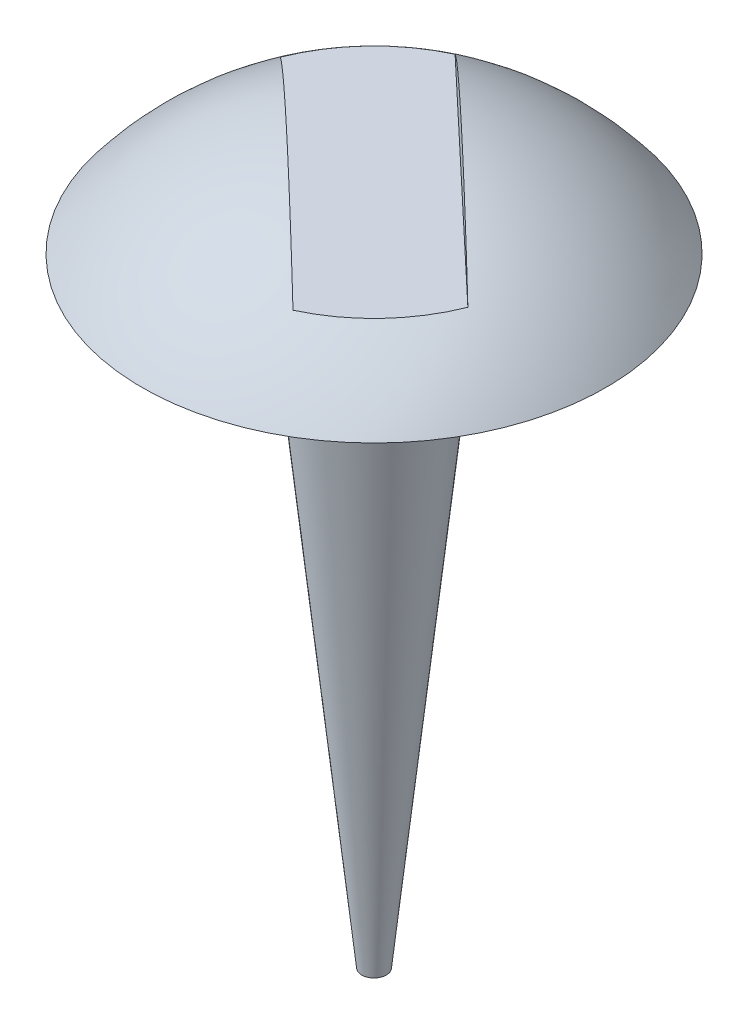
ISO-10303-21;
HEADER;
FILE_DESCRIPTION(('STEP AP214'),'2;1');
FILE_NAME('part.step','',(''),(''),'','','');
FILE_SCHEMA(('AUTOMOTIVE_DESIGN { 1 0 10303 214 1 1 1 1 }'));
ENDSEC;
DATA;
#1=APPLICATION_CONTEXT('core data for automotive mechanical design processes');
#2=APPLICATION_PROTOCOL_DEFINITION('international standard','automotive_design',2000,#1);
#3=PRODUCT_CONTEXT('',#1,'mechanical');
#4=PRODUCT('Part','Part','',(#3));
#5=PRODUCT_RELATED_PRODUCT_CATEGORY('part','',(#4));
#6=PRODUCT_DEFINITION_FORMATION('','',#4);
#7=PRODUCT_DEFINITION_CONTEXT('part definition',#1,'design');
#8=PRODUCT_DEFINITION('design','',#6,#7);
#9=PRODUCT_DEFINITION_SHAPE('','',#8);
#10=(LENGTH_UNIT() NAMED_UNIT(*) SI_UNIT(.MILLI.,.METRE.));
#11=(NAMED_UNIT(*) PLANE_ANGLE_UNIT() SI_UNIT($,.RADIAN.));
#12=(NAMED_UNIT(*) SI_UNIT($,.STERADIAN.) SOLID_ANGLE_UNIT());
#13=UNCERTAINTY_MEASURE_WITH_UNIT(LENGTH_MEASURE(1.E-05),#10,'distance_accuracy_value','');
#14=(GEOMETRIC_REPRESENTATION_CONTEXT(3) GLOBAL_UNCERTAINTY_ASSIGNED_CONTEXT((#13)) GLOBAL_UNIT_ASSIGNED_CONTEXT((#10,
#11,#12)) REPRESENTATION_CONTEXT('',''));
#15=CARTESIAN_POINT('',(0.,0.,0.));
#16=DIRECTION('',(0.,0.,1.));
#17=DIRECTION('',(1.,0.,0.));
#18=AXIS2_PLACEMENT_3D('',#15,#16,#17);
#19=CARTESIAN_POINT('',(0.,0.,0.));
#20=DIRECTION('',(0.,1.,0.));
#21=DIRECTION('',(0.,0.,1.));
#22=AXIS2_PLACEMENT_3D('',#19,#20,#21);
#23=PLANE('',#22);
#24=CARTESIAN_POINT('',(0.,0.,0.));
#25=DIRECTION('',(0.,-1.,0.));
#26=DIRECTION('',(0.,0.,-1.));
#27=AXIS2_PLACEMENT_3D('',#24,#25,#26);
#28=CIRCLE('',#27,0.300000000000002);
#29=CARTESIAN_POINT('',(0.,0.,-0.300000000000002));
#30=VERTEX_POINT('',#29);
#31=EDGE_CURVE('E75',#30,#30,#28,.T.);
#32=ORIENTED_EDGE('',*,*,#31,.T.);
#33=EDGE_LOOP('',(#32));
#34=FACE_BOUND('',#33,.T.);
#35=CARTESIAN_POINT('',(0.,0.,0.));
#36=DIRECTION('',(0.,1.,0.));
#37=DIRECTION('',(0.,0.,1.));
#38=AXIS2_PLACEMENT_3D('',#35,#36,#37);
#39=CIRCLE('',#38,0.1);
#40=CARTESIAN_POINT('',(0.,0.,0.1));
#41=VERTEX_POINT('',#40);
#42=EDGE_CURVE('E71',#41,#41,#39,.F.);
#43=ORIENTED_EDGE('',*,*,#42,.F.);
#44=EDGE_LOOP('',(#43));
#45=FACE_BOUND('',#44,.T.);
#46=ADVANCED_FACE('F33',(#34,#45),#23,.F.);
#47=CARTESIAN_POINT('',(0.,-0.231324998084971,0.));
#48=DIRECTION('',(0.,-1.,0.));
#49=DIRECTION('',(1.,0.,0.));
#50=AXIS2_PLACEMENT_3D('',#47,#48,#49);
#51=SPHERICAL_SURFACE('',#50,0.378828793439745);
#52=CARTESIAN_POINT('',(0.0548952647499614,-0.231324998084971,-0.0581937273942101));
#53=DIRECTION('',(-0.686190809374518,0.,0.727421592427626));
#54=DIRECTION('',(0.727421592427626,0.,0.686190809374518));
#55=AXIS2_PLACEMENT_3D('',#52,#53,#54);
#56=CIRCLE('',#55,0.370285369328864);
#57=CARTESIAN_POINT('',(0.200721071162538,0.08,0.0793665666245485));
#58=VERTEX_POINT('',#57);
#59=CARTESIAN_POINT('',(-0.0909305416626154,0.08,-0.195754021412969));
#60=VERTEX_POINT('',#59);
#61=EDGE_CURVE('E65',#58,#60,#56,.T.);
#62=ORIENTED_EDGE('',*,*,#61,.F.);
#63=CARTESIAN_POINT('',(0.,0.08,0.));
#64=DIRECTION('',(0.,-1.,0.));
#65=DIRECTION('',(0.,0.,-1.));
#66=AXIS2_PLACEMENT_3D('',#63,#64,#65);
#67=CIRCLE('',#66,0.215842535906168);
#68=CARTESIAN_POINT('',(0.0909305416626153,0.08,0.195754021412969));
#69=VERTEX_POINT('',#68);
#70=EDGE_CURVE('E11',#58,#69,#67,.T.);
#71=ORIENTED_EDGE('',*,*,#70,.T.);
#72=CARTESIAN_POINT('',(-0.0548952647499615,-0.231324998084971,0.0581937273942102));
#73=DIRECTION('',(-0.686190809374518,0.,0.727421592427626));
#74=DIRECTION('',(0.727421592427626,0.,0.686190809374518));
#75=AXIS2_PLACEMENT_3D('',#72,#73,#74);
#76=CIRCLE('',#75,0.370285369328864);
#77=CARTESIAN_POINT('',(-0.200721071162538,0.08,-0.0793665666245484));
#78=VERTEX_POINT('',#77);
#79=EDGE_CURVE('E37',#69,#78,#76,.T.);
#80=ORIENTED_EDGE('',*,*,#79,.T.);
#81=EDGE_CURVE('E43',#78,#60,#67,.T.);
#82=ORIENTED_EDGE('',*,*,#81,.T.);
#83=EDGE_LOOP('',(#62,#71,#80,#82));
#84=FACE_BOUND('',#83,.T.);
#85=ORIENTED_EDGE('',*,*,#31,.F.);
#86=EDGE_LOOP('',(#85));
#87=FACE_BOUND('',#86,.T.);
#88=ADVANCED_FACE('F35',(#84,#87),#51,.T.);
#89=CARTESIAN_POINT('',(0.,0.,0.));
#90=DIRECTION('',(0.,1.,0.));
#91=DIRECTION('',(0.,0.,-1.));
#92=AXIS2_PLACEMENT_3D('',#89,#90,#91);
#93=CONICAL_SURFACE('',#92,0.1,0.10471975511966);
#94=CARTESIAN_POINT('',(0.,-0.8,0.));
#95=DIRECTION('',(0.,-1.,0.));
#96=DIRECTION('',(0.,0.,-1.));
#97=AXIS2_PLACEMENT_3D('',#94,#95,#96);
#98=CIRCLE('',#97,0.0159166117874586);
#99=CARTESIAN_POINT('',(0.,-0.8,-0.0159166117874586));
#100=VERTEX_POINT('',#99);
#101=EDGE_CURVE('E78',#100,#100,#98,.T.);
#102=ORIENTED_EDGE('',*,*,#101,.F.);
#103=EDGE_LOOP('',(#102));
#104=FACE_BOUND('',#103,.T.);
#105=ORIENTED_EDGE('',*,*,#42,.T.);
#106=EDGE_LOOP('',(#105));
#107=FACE_BOUND('',#106,.T.);
#108=ADVANCED_FACE('F85',(#104,#107),#93,.T.);
#109=CARTESIAN_POINT('',(0.,-0.8,0.));
#110=DIRECTION('',(0.,-1.,0.));
#111=DIRECTION('',(0.,0.,-1.));
#112=AXIS2_PLACEMENT_3D('',#109,#110,#111);
#113=PLANE('',#112);
#114=ORIENTED_EDGE('',*,*,#101,.T.);
#115=EDGE_LOOP('',(#114));
#116=FACE_BOUND('',#115,.T.);
#117=ADVANCED_FACE('F83',(#116),#113,.T.);
#118=CARTESIAN_POINT('',(-0.452676574892829,5.08,-0.317041049800209));
#119=DIRECTION('',(-0.686190809374518,0.,0.727421592427626));
#120=DIRECTION('',(0.727421592427626,0.,0.686190809374518));
#121=AXIS2_PLACEMENT_3D('',#118,#119,#120);
#122=PLANE('',#121);
#123=DIRECTION('',(-0.727421592427626,0.,-0.686190809374518));
#124=VECTOR('',#123,1.);
#125=CARTESIAN_POINT('',(-0.452676574892829,0.08,-0.317041049800209));
#126=LINE('',#125,#124);
#127=EDGE_CURVE('E62',#69,#78,#126,.T.);
#128=ORIENTED_EDGE('',*,*,#127,.T.);
#129=ORIENTED_EDGE('',*,*,#79,.F.);
#130=EDGE_LOOP('',(#128,#129));
#131=FACE_BOUND('',#130,.T.);
#132=ADVANCED_FACE('F61',(#131),#122,.F.);
#133=CARTESIAN_POINT('',(-0.342886045392906,5.08,-0.43342850458863));
#134=DIRECTION('',(-0.686190809374518,0.,0.727421592427626));
#135=DIRECTION('',(0.727421592427626,0.,0.686190809374518));
#136=AXIS2_PLACEMENT_3D('',#133,#134,#135);
#137=PLANE('',#136);
#138=ORIENTED_EDGE('',*,*,#61,.T.);
#139=DIRECTION('',(-0.727421592427626,0.,-0.686190809374518));
#140=VECTOR('',#139,1.);
#141=CARTESIAN_POINT('',(-0.342886045392906,0.08,-0.43342850458863));
#142=LINE('',#141,#140);
#143=EDGE_CURVE('E50',#58,#60,#142,.T.);
#144=ORIENTED_EDGE('',*,*,#143,.F.);
#145=EDGE_LOOP('',(#138,#144));
#146=FACE_BOUND('',#145,.T.);
#147=ADVANCED_FACE('F102',(#146),#137,.T.);
#148=CARTESIAN_POINT('',(-0.00113410715786815,0.08,-0.795715110194384));
#149=DIRECTION('',(0.,-1.,0.));
#150=DIRECTION('',(0.,0.,-1.));
#151=AXIS2_PLACEMENT_3D('',#148,#149,#150);
#152=PLANE('',#151);
#153=ORIENTED_EDGE('',*,*,#143,.T.);
#154=ORIENTED_EDGE('',*,*,#81,.F.);
#155=ORIENTED_EDGE('',*,*,#127,.F.);
#156=ORIENTED_EDGE('',*,*,#70,.F.);
#157=EDGE_LOOP('',(#153,#154,#155,#156));
#158=FACE_BOUND('',#157,.T.);
#159=ADVANCED_FACE('F66',(#158),#152,.F.);
#160=CLOSED_SHELL('',(#46,#88,#108,#117,#132,#147,#159));
#161=MANIFOLD_SOLID_BREP('B2',#160);
#162=ADVANCED_BREP_SHAPE_REPRESENTATION('',(#18,#161),#14);
#163=SHAPE_DEFINITION_REPRESENTATION(#9,#162);
ENDSEC;
END-ISO-10303-21;
